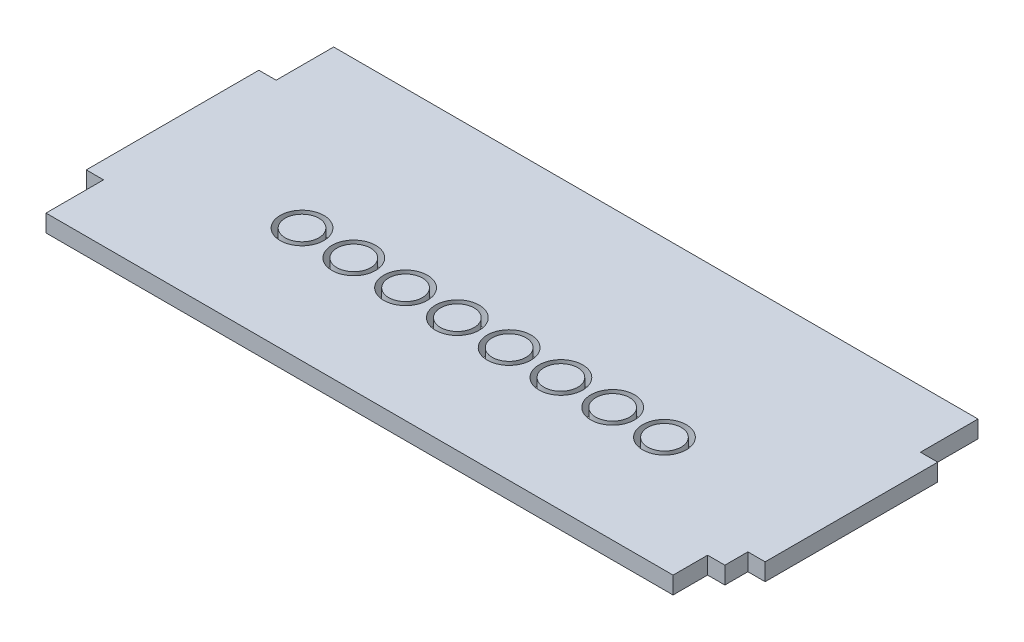
ISO-10303-21;
HEADER;
FILE_DESCRIPTION(('STEP AP214'),'2;1');
FILE_NAME('part.step','',(''),(''),'','','');
FILE_SCHEMA(('AUTOMOTIVE_DESIGN { 1 0 10303 214 1 1 1 1 }'));
ENDSEC;
DATA;
#1=APPLICATION_CONTEXT('core data for automotive mechanical design processes');
#2=APPLICATION_PROTOCOL_DEFINITION('international standard','automotive_design',2000,#1);
#3=PRODUCT_CONTEXT('',#1,'mechanical');
#4=PRODUCT('Part','Part','',(#3));
#5=PRODUCT_RELATED_PRODUCT_CATEGORY('part','',(#4));
#6=PRODUCT_DEFINITION_FORMATION('','',#4);
#7=PRODUCT_DEFINITION_CONTEXT('part definition',#1,'design');
#8=PRODUCT_DEFINITION('design','',#6,#7);
#9=PRODUCT_DEFINITION_SHAPE('','',#8);
#10=(LENGTH_UNIT() NAMED_UNIT(*) SI_UNIT(.MILLI.,.METRE.));
#11=(NAMED_UNIT(*) PLANE_ANGLE_UNIT() SI_UNIT($,.RADIAN.));
#12=(NAMED_UNIT(*) SI_UNIT($,.STERADIAN.) SOLID_ANGLE_UNIT());
#13=UNCERTAINTY_MEASURE_WITH_UNIT(LENGTH_MEASURE(1.E-05),#10,'distance_accuracy_value','');
#14=(GEOMETRIC_REPRESENTATION_CONTEXT(3) GLOBAL_UNCERTAINTY_ASSIGNED_CONTEXT((#13)) GLOBAL_UNIT_ASSIGNED_CONTEXT((#10,
#11,#12)) REPRESENTATION_CONTEXT('',''));
#15=CARTESIAN_POINT('',(0.,0.,0.));
#16=DIRECTION('',(0.,0.,1.));
#17=DIRECTION('',(1.,0.,0.));
#18=AXIS2_PLACEMENT_3D('',#15,#16,#17);
#19=CARTESIAN_POINT('',(-90.5000000000015,0.,129.999999999999));
#20=DIRECTION('',(0.,1.,0.));
#21=DIRECTION('',(0.,0.,1.));
#22=AXIS2_PLACEMENT_3D('',#19,#20,#21);
#23=CYLINDRICAL_SURFACE('',#22,2.93490979553741);
#24=CARTESIAN_POINT('',(-90.5000000000015,0.,129.999999999999));
#25=DIRECTION('',(0.,1.,0.));
#26=DIRECTION('',(0.,0.,1.));
#27=AXIS2_PLACEMENT_3D('',#24,#25,#26);
#28=CIRCLE('',#27,2.93490979553741);
#29=CARTESIAN_POINT('',(-90.5000000000015,0.,132.934909795537));
#30=VERTEX_POINT('',#29);
#31=EDGE_CURVE('E11',#30,#30,#28,.T.);
#32=ORIENTED_EDGE('',*,*,#31,.T.);
#33=EDGE_LOOP('',(#32));
#34=FACE_BOUND('',#33,.T.);
#35=CARTESIAN_POINT('',(-90.5000000000015,3.,129.999999999999));
#36=DIRECTION('',(0.,1.,0.));
#37=DIRECTION('',(0.,0.,1.));
#38=AXIS2_PLACEMENT_3D('',#35,#36,#37);
#39=CIRCLE('',#38,2.93490979553741);
#40=CARTESIAN_POINT('',(-90.5000000000015,3.,132.934909795537));
#41=VERTEX_POINT('',#40);
#42=EDGE_CURVE('E46',#41,#41,#39,.T.);
#43=ORIENTED_EDGE('',*,*,#42,.F.);
#44=EDGE_LOOP('',(#43));
#45=FACE_BOUND('',#44,.T.);
#46=ADVANCED_FACE('F43',(#34,#45),#23,.T.);
#47=CARTESIAN_POINT('',(-90.5000000000015,0.,129.999999999999));
#48=DIRECTION('',(0.,1.,0.));
#49=DIRECTION('',(0.,0.,1.));
#50=AXIS2_PLACEMENT_3D('',#47,#48,#49);
#51=PLANE('',#50);
#52=ORIENTED_EDGE('',*,*,#31,.F.);
#53=EDGE_LOOP('',(#52));
#54=FACE_BOUND('',#53,.T.);
#55=ADVANCED_FACE('F58',(#54),#51,.F.);
#56=CARTESIAN_POINT('',(-90.5000000000015,3.,129.999999999999));
#57=DIRECTION('',(0.,1.,0.));
#58=DIRECTION('',(0.,0.,1.));
#59=AXIS2_PLACEMENT_3D('',#56,#57,#58);
#60=PLANE('',#59);
#61=ORIENTED_EDGE('',*,*,#42,.T.);
#62=EDGE_LOOP('',(#61));
#63=FACE_BOUND('',#62,.T.);
#64=ADVANCED_FACE('F55',(#63),#60,.T.);
#65=CLOSED_SHELL('',(#46,#55,#64));
#66=MANIFOLD_SOLID_BREP('B2',#65);
#67=CARTESIAN_POINT('',(-81.5000000000015,0.,129.999999999999));
#68=DIRECTION('',(0.,1.,0.));
#69=DIRECTION('',(0.,0.,1.));
#70=AXIS2_PLACEMENT_3D('',#67,#68,#69);
#71=CYLINDRICAL_SURFACE('',#70,2.93490979553741);
#72=CARTESIAN_POINT('',(-81.5000000000015,0.,129.999999999999));
#73=DIRECTION('',(0.,1.,0.));
#74=DIRECTION('',(0.,0.,1.));
#75=AXIS2_PLACEMENT_3D('',#72,#73,#74);
#76=CIRCLE('',#75,2.93490979553741);
#77=CARTESIAN_POINT('',(-81.5000000000015,0.,132.934909795537));
#78=VERTEX_POINT('',#77);
#79=EDGE_CURVE('E42',#78,#78,#76,.T.);
#80=ORIENTED_EDGE('',*,*,#79,.T.);
#81=EDGE_LOOP('',(#80));
#82=FACE_BOUND('',#81,.T.);
#83=CARTESIAN_POINT('',(-81.5000000000015,3.,129.999999999999));
#84=DIRECTION('',(0.,1.,0.));
#85=DIRECTION('',(0.,0.,1.));
#86=AXIS2_PLACEMENT_3D('',#83,#84,#85);
#87=CIRCLE('',#86,2.93490979553741);
#88=CARTESIAN_POINT('',(-81.5000000000015,3.,132.934909795537));
#89=VERTEX_POINT('',#88);
#90=EDGE_CURVE('E94',#89,#89,#87,.T.);
#91=ORIENTED_EDGE('',*,*,#90,.F.);
#92=EDGE_LOOP('',(#91));
#93=FACE_BOUND('',#92,.T.);
#94=ADVANCED_FACE('F91',(#82,#93),#71,.T.);
#95=CARTESIAN_POINT('',(-81.5000000000015,0.,129.999999999999));
#96=DIRECTION('',(0.,1.,0.));
#97=DIRECTION('',(0.,0.,1.));
#98=AXIS2_PLACEMENT_3D('',#95,#96,#97);
#99=PLANE('',#98);
#100=ORIENTED_EDGE('',*,*,#79,.F.);
#101=EDGE_LOOP('',(#100));
#102=FACE_BOUND('',#101,.T.);
#103=ADVANCED_FACE('F106',(#102),#99,.F.);
#104=CARTESIAN_POINT('',(-81.5000000000015,3.,129.999999999999));
#105=DIRECTION('',(0.,1.,0.));
#106=DIRECTION('',(0.,0.,1.));
#107=AXIS2_PLACEMENT_3D('',#104,#105,#106);
#108=PLANE('',#107);
#109=ORIENTED_EDGE('',*,*,#90,.T.);
#110=EDGE_LOOP('',(#109));
#111=FACE_BOUND('',#110,.T.);
#112=ADVANCED_FACE('F103',(#111),#108,.T.);
#113=CLOSED_SHELL('',(#94,#103,#112));
#114=MANIFOLD_SOLID_BREP('B6',#113);
#115=CARTESIAN_POINT('',(-72.5000000000015,0.,129.999999999999));
#116=DIRECTION('',(0.,1.,0.));
#117=DIRECTION('',(0.,0.,1.));
#118=AXIS2_PLACEMENT_3D('',#115,#116,#117);
#119=CYLINDRICAL_SURFACE('',#118,2.93490979553741);
#120=CARTESIAN_POINT('',(-72.5000000000015,0.,129.999999999999));
#121=DIRECTION('',(0.,1.,0.));
#122=DIRECTION('',(0.,0.,1.));
#123=AXIS2_PLACEMENT_3D('',#120,#121,#122);
#124=CIRCLE('',#123,2.93490979553741);
#125=CARTESIAN_POINT('',(-72.5000000000015,0.,132.934909795537));
#126=VERTEX_POINT('',#125);
#127=EDGE_CURVE('E90',#126,#126,#124,.T.);
#128=ORIENTED_EDGE('',*,*,#127,.T.);
#129=EDGE_LOOP('',(#128));
#130=FACE_BOUND('',#129,.T.);
#131=CARTESIAN_POINT('',(-72.5000000000015,3.,129.999999999999));
#132=DIRECTION('',(0.,1.,0.));
#133=DIRECTION('',(0.,0.,1.));
#134=AXIS2_PLACEMENT_3D('',#131,#132,#133);
#135=CIRCLE('',#134,2.93490979553741);
#136=CARTESIAN_POINT('',(-72.5000000000015,3.,132.934909795537));
#137=VERTEX_POINT('',#136);
#138=EDGE_CURVE('E142',#137,#137,#135,.T.);
#139=ORIENTED_EDGE('',*,*,#138,.F.);
#140=EDGE_LOOP('',(#139));
#141=FACE_BOUND('',#140,.T.);
#142=ADVANCED_FACE('F139',(#130,#141),#119,.T.);
#143=CARTESIAN_POINT('',(-72.5000000000015,0.,129.999999999999));
#144=DIRECTION('',(0.,1.,0.));
#145=DIRECTION('',(0.,0.,1.));
#146=AXIS2_PLACEMENT_3D('',#143,#144,#145);
#147=PLANE('',#146);
#148=ORIENTED_EDGE('',*,*,#127,.F.);
#149=EDGE_LOOP('',(#148));
#150=FACE_BOUND('',#149,.T.);
#151=ADVANCED_FACE('F154',(#150),#147,.F.);
#152=CARTESIAN_POINT('',(-72.5000000000015,3.,129.999999999999));
#153=DIRECTION('',(0.,1.,0.));
#154=DIRECTION('',(0.,0.,1.));
#155=AXIS2_PLACEMENT_3D('',#152,#153,#154);
#156=PLANE('',#155);
#157=ORIENTED_EDGE('',*,*,#138,.T.);
#158=EDGE_LOOP('',(#157));
#159=FACE_BOUND('',#158,.T.);
#160=ADVANCED_FACE('F151',(#159),#156,.T.);
#161=CLOSED_SHELL('',(#142,#151,#160));
#162=MANIFOLD_SOLID_BREP('B37',#161);
#163=CARTESIAN_POINT('',(-63.5000000000015,0.,129.999999999999));
#164=DIRECTION('',(0.,1.,0.));
#165=DIRECTION('',(0.,0.,1.));
#166=AXIS2_PLACEMENT_3D('',#163,#164,#165);
#167=CYLINDRICAL_SURFACE('',#166,2.93490979553742);
#168=CARTESIAN_POINT('',(-63.5000000000015,0.,129.999999999999));
#169=DIRECTION('',(0.,1.,0.));
#170=DIRECTION('',(0.,0.,1.));
#171=AXIS2_PLACEMENT_3D('',#168,#169,#170);
#172=CIRCLE('',#171,2.93490979553742);
#173=CARTESIAN_POINT('',(-63.5000000000015,0.,132.934909795537));
#174=VERTEX_POINT('',#173);
#175=EDGE_CURVE('E138',#174,#174,#172,.T.);
#176=ORIENTED_EDGE('',*,*,#175,.T.);
#177=EDGE_LOOP('',(#176));
#178=FACE_BOUND('',#177,.T.);
#179=CARTESIAN_POINT('',(-63.5000000000015,3.,129.999999999999));
#180=DIRECTION('',(0.,1.,0.));
#181=DIRECTION('',(0.,0.,1.));
#182=AXIS2_PLACEMENT_3D('',#179,#180,#181);
#183=CIRCLE('',#182,2.93490979553742);
#184=CARTESIAN_POINT('',(-63.5000000000015,3.,132.934909795537));
#185=VERTEX_POINT('',#184);
#186=EDGE_CURVE('E190',#185,#185,#183,.T.);
#187=ORIENTED_EDGE('',*,*,#186,.F.);
#188=EDGE_LOOP('',(#187));
#189=FACE_BOUND('',#188,.T.);
#190=ADVANCED_FACE('F187',(#178,#189),#167,.T.);
#191=CARTESIAN_POINT('',(-63.5000000000015,0.,129.999999999999));
#192=DIRECTION('',(0.,1.,0.));
#193=DIRECTION('',(0.,0.,1.));
#194=AXIS2_PLACEMENT_3D('',#191,#192,#193);
#195=PLANE('',#194);
#196=ORIENTED_EDGE('',*,*,#175,.F.);
#197=EDGE_LOOP('',(#196));
#198=FACE_BOUND('',#197,.T.);
#199=ADVANCED_FACE('F202',(#198),#195,.F.);
#200=CARTESIAN_POINT('',(-63.5000000000015,3.,129.999999999999));
#201=DIRECTION('',(0.,1.,0.));
#202=DIRECTION('',(0.,0.,1.));
#203=AXIS2_PLACEMENT_3D('',#200,#201,#202);
#204=PLANE('',#203);
#205=ORIENTED_EDGE('',*,*,#186,.T.);
#206=EDGE_LOOP('',(#205));
#207=FACE_BOUND('',#206,.T.);
#208=ADVANCED_FACE('F199',(#207),#204,.T.);
#209=CLOSED_SHELL('',(#190,#199,#208));
#210=MANIFOLD_SOLID_BREP('B85',#209);
#211=CARTESIAN_POINT('',(-54.5000000000015,0.,129.999999999999));
#212=DIRECTION('',(0.,1.,0.));
#213=DIRECTION('',(0.,0.,1.));
#214=AXIS2_PLACEMENT_3D('',#211,#212,#213);
#215=CYLINDRICAL_SURFACE('',#214,2.93490979553741);
#216=CARTESIAN_POINT('',(-54.5000000000015,0.,129.999999999999));
#217=DIRECTION('',(0.,1.,0.));
#218=DIRECTION('',(0.,0.,1.));
#219=AXIS2_PLACEMENT_3D('',#216,#217,#218);
#220=CIRCLE('',#219,2.93490979553741);
#221=CARTESIAN_POINT('',(-54.5000000000015,0.,132.934909795536));
#222=VERTEX_POINT('',#221);
#223=EDGE_CURVE('E186',#222,#222,#220,.T.);
#224=ORIENTED_EDGE('',*,*,#223,.T.);
#225=EDGE_LOOP('',(#224));
#226=FACE_BOUND('',#225,.T.);
#227=CARTESIAN_POINT('',(-54.5000000000015,3.,129.999999999999));
#228=DIRECTION('',(0.,1.,0.));
#229=DIRECTION('',(0.,0.,1.));
#230=AXIS2_PLACEMENT_3D('',#227,#228,#229);
#231=CIRCLE('',#230,2.93490979553741);
#232=CARTESIAN_POINT('',(-54.5000000000015,3.,132.934909795536));
#233=VERTEX_POINT('',#232);
#234=EDGE_CURVE('E238',#233,#233,#231,.T.);
#235=ORIENTED_EDGE('',*,*,#234,.F.);
#236=EDGE_LOOP('',(#235));
#237=FACE_BOUND('',#236,.T.);
#238=ADVANCED_FACE('F235',(#226,#237),#215,.T.);
#239=CARTESIAN_POINT('',(-54.5000000000015,0.,129.999999999999));
#240=DIRECTION('',(0.,1.,0.));
#241=DIRECTION('',(0.,0.,1.));
#242=AXIS2_PLACEMENT_3D('',#239,#240,#241);
#243=PLANE('',#242);
#244=ORIENTED_EDGE('',*,*,#223,.F.);
#245=EDGE_LOOP('',(#244));
#246=FACE_BOUND('',#245,.T.);
#247=ADVANCED_FACE('F250',(#246),#243,.F.);
#248=CARTESIAN_POINT('',(-54.5000000000015,3.,129.999999999999));
#249=DIRECTION('',(0.,1.,0.));
#250=DIRECTION('',(0.,0.,1.));
#251=AXIS2_PLACEMENT_3D('',#248,#249,#250);
#252=PLANE('',#251);
#253=ORIENTED_EDGE('',*,*,#234,.T.);
#254=EDGE_LOOP('',(#253));
#255=FACE_BOUND('',#254,.T.);
#256=ADVANCED_FACE('F247',(#255),#252,.T.);
#257=CLOSED_SHELL('',(#238,#247,#256));
#258=MANIFOLD_SOLID_BREP('B133',#257);
#259=CARTESIAN_POINT('',(-45.5000000000015,0.,129.999999999999));
#260=DIRECTION('',(0.,1.,0.));
#261=DIRECTION('',(0.,0.,1.));
#262=AXIS2_PLACEMENT_3D('',#259,#260,#261);
#263=CYLINDRICAL_SURFACE('',#262,2.93490979553741);
#264=CARTESIAN_POINT('',(-45.5000000000015,0.,129.999999999999));
#265=DIRECTION('',(0.,1.,0.));
#266=DIRECTION('',(0.,0.,1.));
#267=AXIS2_PLACEMENT_3D('',#264,#265,#266);
#268=CIRCLE('',#267,2.93490979553741);
#269=CARTESIAN_POINT('',(-45.5000000000015,0.,132.934909795536));
#270=VERTEX_POINT('',#269);
#271=EDGE_CURVE('E234',#270,#270,#268,.T.);
#272=ORIENTED_EDGE('',*,*,#271,.T.);
#273=EDGE_LOOP('',(#272));
#274=FACE_BOUND('',#273,.T.);
#275=CARTESIAN_POINT('',(-45.5000000000015,3.,129.999999999999));
#276=DIRECTION('',(0.,1.,0.));
#277=DIRECTION('',(0.,0.,1.));
#278=AXIS2_PLACEMENT_3D('',#275,#276,#277);
#279=CIRCLE('',#278,2.93490979553741);
#280=CARTESIAN_POINT('',(-45.5000000000015,3.,132.934909795536));
#281=VERTEX_POINT('',#280);
#282=EDGE_CURVE('E286',#281,#281,#279,.T.);
#283=ORIENTED_EDGE('',*,*,#282,.F.);
#284=EDGE_LOOP('',(#283));
#285=FACE_BOUND('',#284,.T.);
#286=ADVANCED_FACE('F283',(#274,#285),#263,.T.);
#287=CARTESIAN_POINT('',(-45.5000000000015,0.,129.999999999999));
#288=DIRECTION('',(0.,1.,0.));
#289=DIRECTION('',(0.,0.,1.));
#290=AXIS2_PLACEMENT_3D('',#287,#288,#289);
#291=PLANE('',#290);
#292=ORIENTED_EDGE('',*,*,#271,.F.);
#293=EDGE_LOOP('',(#292));
#294=FACE_BOUND('',#293,.T.);
#295=ADVANCED_FACE('F298',(#294),#291,.F.);
#296=CARTESIAN_POINT('',(-45.5000000000015,3.,129.999999999999));
#297=DIRECTION('',(0.,1.,0.));
#298=DIRECTION('',(0.,0.,1.));
#299=AXIS2_PLACEMENT_3D('',#296,#297,#298);
#300=PLANE('',#299);
#301=ORIENTED_EDGE('',*,*,#282,.T.);
#302=EDGE_LOOP('',(#301));
#303=FACE_BOUND('',#302,.T.);
#304=ADVANCED_FACE('F295',(#303),#300,.T.);
#305=CLOSED_SHELL('',(#286,#295,#304));
#306=MANIFOLD_SOLID_BREP('B181',#305);
#307=CARTESIAN_POINT('',(-36.5000000000015,0.,129.999999999999));
#308=DIRECTION('',(0.,1.,0.));
#309=DIRECTION('',(0.,0.,1.));
#310=AXIS2_PLACEMENT_3D('',#307,#308,#309);
#311=CYLINDRICAL_SURFACE('',#310,2.93490979553741);
#312=CARTESIAN_POINT('',(-36.5000000000015,0.,129.999999999999));
#313=DIRECTION('',(0.,1.,0.));
#314=DIRECTION('',(0.,0.,1.));
#315=AXIS2_PLACEMENT_3D('',#312,#313,#314);
#316=CIRCLE('',#315,2.93490979553741);
#317=CARTESIAN_POINT('',(-36.5000000000015,0.,132.934909795536));
#318=VERTEX_POINT('',#317);
#319=EDGE_CURVE('E282',#318,#318,#316,.T.);
#320=ORIENTED_EDGE('',*,*,#319,.T.);
#321=EDGE_LOOP('',(#320));
#322=FACE_BOUND('',#321,.T.);
#323=CARTESIAN_POINT('',(-36.5000000000015,3.,129.999999999999));
#324=DIRECTION('',(0.,1.,0.));
#325=DIRECTION('',(0.,0.,1.));
#326=AXIS2_PLACEMENT_3D('',#323,#324,#325);
#327=CIRCLE('',#326,2.93490979553741);
#328=CARTESIAN_POINT('',(-36.5000000000015,3.,132.934909795536));
#329=VERTEX_POINT('',#328);
#330=EDGE_CURVE('E334',#329,#329,#327,.T.);
#331=ORIENTED_EDGE('',*,*,#330,.F.);
#332=EDGE_LOOP('',(#331));
#333=FACE_BOUND('',#332,.T.);
#334=ADVANCED_FACE('F331',(#322,#333),#311,.T.);
#335=CARTESIAN_POINT('',(-36.5000000000015,0.,129.999999999999));
#336=DIRECTION('',(0.,1.,0.));
#337=DIRECTION('',(0.,0.,1.));
#338=AXIS2_PLACEMENT_3D('',#335,#336,#337);
#339=PLANE('',#338);
#340=ORIENTED_EDGE('',*,*,#319,.F.);
#341=EDGE_LOOP('',(#340));
#342=FACE_BOUND('',#341,.T.);
#343=ADVANCED_FACE('F346',(#342),#339,.F.);
#344=CARTESIAN_POINT('',(-36.5000000000015,3.,129.999999999999));
#345=DIRECTION('',(0.,1.,0.));
#346=DIRECTION('',(0.,0.,1.));
#347=AXIS2_PLACEMENT_3D('',#344,#345,#346);
#348=PLANE('',#347);
#349=ORIENTED_EDGE('',*,*,#330,.T.);
#350=EDGE_LOOP('',(#349));
#351=FACE_BOUND('',#350,.T.);
#352=ADVANCED_FACE('F343',(#351),#348,.T.);
#353=CLOSED_SHELL('',(#334,#343,#352));
#354=MANIFOLD_SOLID_BREP('B229',#353);
#355=CARTESIAN_POINT('',(-27.5000000000015,0.,129.999999999999));
#356=DIRECTION('',(0.,1.,0.));
#357=DIRECTION('',(0.,0.,1.));
#358=AXIS2_PLACEMENT_3D('',#355,#356,#357);
#359=CYLINDRICAL_SURFACE('',#358,2.93490979553741);
#360=CARTESIAN_POINT('',(-27.5000000000015,0.,129.999999999999));
#361=DIRECTION('',(0.,1.,0.));
#362=DIRECTION('',(0.,0.,1.));
#363=AXIS2_PLACEMENT_3D('',#360,#361,#362);
#364=CIRCLE('',#363,2.93490979553741);
#365=CARTESIAN_POINT('',(-27.5000000000015,0.,132.934909795536));
#366=VERTEX_POINT('',#365);
#367=EDGE_CURVE('E330',#366,#366,#364,.T.);
#368=ORIENTED_EDGE('',*,*,#367,.T.);
#369=EDGE_LOOP('',(#368));
#370=FACE_BOUND('',#369,.T.);
#371=CARTESIAN_POINT('',(-27.5000000000015,3.,129.999999999999));
#372=DIRECTION('',(0.,1.,0.));
#373=DIRECTION('',(0.,0.,1.));
#374=AXIS2_PLACEMENT_3D('',#371,#372,#373);
#375=CIRCLE('',#374,2.93490979553741);
#376=CARTESIAN_POINT('',(-27.5000000000015,3.,132.934909795536));
#377=VERTEX_POINT('',#376);
#378=EDGE_CURVE('E383',#377,#377,#375,.T.);
#379=ORIENTED_EDGE('',*,*,#378,.F.);
#380=EDGE_LOOP('',(#379));
#381=FACE_BOUND('',#380,.T.);
#382=ADVANCED_FACE('F380',(#370,#381),#359,.T.);
#383=CARTESIAN_POINT('',(-27.5000000000015,0.,129.999999999999));
#384=DIRECTION('',(0.,1.,0.));
#385=DIRECTION('',(0.,0.,1.));
#386=AXIS2_PLACEMENT_3D('',#383,#384,#385);
#387=PLANE('',#386);
#388=ORIENTED_EDGE('',*,*,#367,.F.);
#389=EDGE_LOOP('',(#388));
#390=FACE_BOUND('',#389,.T.);
#391=ADVANCED_FACE('F395',(#390),#387,.F.);
#392=CARTESIAN_POINT('',(-27.5000000000015,3.,129.999999999999));
#393=DIRECTION('',(0.,1.,0.));
#394=DIRECTION('',(0.,0.,1.));
#395=AXIS2_PLACEMENT_3D('',#392,#393,#394);
#396=PLANE('',#395);
#397=ORIENTED_EDGE('',*,*,#378,.T.);
#398=EDGE_LOOP('',(#397));
#399=FACE_BOUND('',#398,.T.);
#400=ADVANCED_FACE('F392',(#399),#396,.T.);
#401=CLOSED_SHELL('',(#382,#391,#400));
#402=MANIFOLD_SOLID_BREP('B277',#401);
#403=CARTESIAN_POINT('',(-1.5404344466674E-12,12.,139.999999999999));
#404=DIRECTION('',(0.,0.,-1.));
#405=DIRECTION('',(-1.,0.,0.));
#406=AXIS2_PLACEMENT_3D('',#403,#404,#405);
#407=PLANE('',#406);
#408=DIRECTION('',(1.,0.,0.));
#409=VECTOR('',#408,1.);
#410=CARTESIAN_POINT('',(-1.5404344466674E-12,3.,139.999999999999));
#411=LINE('',#410,#409);
#412=CARTESIAN_POINT('',(-3.00000000000154,3.,139.999999999999));
#413=VERTEX_POINT('',#412);
#414=CARTESIAN_POINT('',(-1.5404344466674E-12,3.,139.999999999999));
#415=VERTEX_POINT('',#414);
#416=EDGE_CURVE('E434',#413,#415,#411,.T.);
#417=ORIENTED_EDGE('',*,*,#416,.F.);
#418=DIRECTION('',(0.,1.,0.));
#419=VECTOR('',#418,1.);
#420=CARTESIAN_POINT('',(-3.00000000000154,0.,139.999999999999));
#421=LINE('',#420,#419);
#422=CARTESIAN_POINT('',(-3.00000000000154,0.,139.999999999999));
#423=VERTEX_POINT('',#422);
#424=EDGE_CURVE('E563',#423,#413,#421,.T.);
#425=ORIENTED_EDGE('',*,*,#424,.F.);
#426=DIRECTION('',(1.,0.,0.));
#427=VECTOR('',#426,1.);
#428=CARTESIAN_POINT('',(-1.5404344466674E-12,0.,139.999999999999));
#429=LINE('',#428,#427);
#430=CARTESIAN_POINT('',(-1.5404344466674E-12,0.,139.999999999999));
#431=VERTEX_POINT('',#430);
#432=EDGE_CURVE('E579',#423,#431,#429,.T.);
#433=ORIENTED_EDGE('',*,*,#432,.T.);
#434=DIRECTION('',(0.,1.,0.));
#435=VECTOR('',#434,1.);
#436=CARTESIAN_POINT('',(-1.5404344466674E-12,0.,139.999999999999));
#437=LINE('',#436,#435);
#438=EDGE_CURVE('E626',#431,#415,#437,.T.);
#439=ORIENTED_EDGE('',*,*,#438,.T.);
#440=EDGE_LOOP('',(#417,#425,#433,#439));
#441=FACE_BOUND('',#440,.T.);
#442=ADVANCED_FACE('F420',(#441),#407,.F.);
#443=CARTESIAN_POINT('',(-1.62370117351429E-12,12.,109.999999999999));
#444=DIRECTION('',(0.,0.,-1.));
#445=DIRECTION('',(-1.,0.,0.));
#446=AXIS2_PLACEMENT_3D('',#443,#444,#445);
#447=PLANE('',#446);
#448=DIRECTION('',(0.,1.,0.));
#449=VECTOR('',#448,1.);
#450=CARTESIAN_POINT('',(-2.99999999999846,0.,109.999999999999));
#451=LINE('',#450,#449);
#452=CARTESIAN_POINT('',(-2.99999999999846,0.,109.999999999999));
#453=VERTEX_POINT('',#452);
#454=CARTESIAN_POINT('',(-2.99999999999846,3.,109.999999999999));
#455=VERTEX_POINT('',#454);
#456=EDGE_CURVE('E594',#453,#455,#451,.T.);
#457=ORIENTED_EDGE('',*,*,#456,.T.);
#458=DIRECTION('',(1.,0.,0.));
#459=VECTOR('',#458,1.);
#460=CARTESIAN_POINT('',(-1.62370117351429E-12,3.,109.999999999999));
#461=LINE('',#460,#459);
#462=CARTESIAN_POINT('',(-1.52395457364563E-12,3.,109.999999999999));
#463=VERTEX_POINT('',#462);
#464=EDGE_CURVE('E634',#455,#463,#461,.T.);
#465=ORIENTED_EDGE('',*,*,#464,.T.);
#466=DIRECTION('',(0.,1.,0.));
#467=VECTOR('',#466,1.);
#468=CARTESIAN_POINT('',(-3.05311331771916E-13,0.,109.999999999999));
#469=LINE('',#468,#467);
#470=CARTESIAN_POINT('',(-1.5404344466674E-12,0.,109.999999999999));
#471=VERTEX_POINT('',#470);
#472=EDGE_CURVE('E625',#471,#463,#469,.T.);
#473=ORIENTED_EDGE('',*,*,#472,.F.);
#474=DIRECTION('',(1.,0.,0.));
#475=VECTOR('',#474,1.);
#476=CARTESIAN_POINT('',(-1.62370117351429E-12,0.,109.999999999999));
#477=LINE('',#476,#475);
#478=EDGE_CURVE('E601',#453,#471,#477,.T.);
#479=ORIENTED_EDGE('',*,*,#478,.F.);
#480=EDGE_LOOP('',(#457,#465,#473,#479));
#481=FACE_BOUND('',#480,.T.);
#482=ADVANCED_FACE('F738',(#481),#447,.T.);
#483=CARTESIAN_POINT('',(-118.000000000001,12.,109.999999999999));
#484=DIRECTION('',(0.,0.,1.));
#485=DIRECTION('',(1.,0.,0.));
#486=AXIS2_PLACEMENT_3D('',#483,#484,#485);
#487=PLANE('',#486);
#488=DIRECTION('',(-1.,0.,0.));
#489=VECTOR('',#488,1.);
#490=CARTESIAN_POINT('',(-118.000000000001,3.,109.999999999999));
#491=LINE('',#490,#489);
#492=CARTESIAN_POINT('',(-115.000000000005,3.,109.999999999999));
#493=VERTEX_POINT('',#492);
#494=CARTESIAN_POINT('',(-118.000000000002,3.,109.999999999999));
#495=VERTEX_POINT('',#494);
#496=EDGE_CURVE('E518',#493,#495,#491,.T.);
#497=ORIENTED_EDGE('',*,*,#496,.F.);
#498=DIRECTION('',(0.,1.,0.));
#499=VECTOR('',#498,1.);
#500=CARTESIAN_POINT('',(-115.000000000005,0.,109.999999999999));
#501=LINE('',#500,#499);
#502=CARTESIAN_POINT('',(-115.000000000005,0.,109.999999999999));
#503=VERTEX_POINT('',#502);
#504=EDGE_CURVE('E592',#503,#493,#501,.T.);
#505=ORIENTED_EDGE('',*,*,#504,.F.);
#506=DIRECTION('',(-1.,0.,0.));
#507=VECTOR('',#506,1.);
#508=CARTESIAN_POINT('',(-118.000000000001,0.,109.999999999999));
#509=LINE('',#508,#507);
#510=CARTESIAN_POINT('',(-118.000000000001,0.,109.999999999999));
#511=VERTEX_POINT('',#510);
#512=EDGE_CURVE('E543',#503,#511,#509,.T.);
#513=ORIENTED_EDGE('',*,*,#512,.T.);
#514=DIRECTION('',(0.,1.,0.));
#515=VECTOR('',#514,1.);
#516=CARTESIAN_POINT('',(-118.000000000001,0.,109.999999999999));
#517=LINE('',#516,#515);
#518=EDGE_CURVE('E534',#511,#495,#517,.T.);
#519=ORIENTED_EDGE('',*,*,#518,.T.);
#520=EDGE_LOOP('',(#497,#505,#513,#519));
#521=FACE_BOUND('',#520,.T.);
#522=ADVANCED_FACE('F542',(#521),#487,.F.);
#523=CARTESIAN_POINT('',(-118.000000000002,12.,139.999999999999));
#524=DIRECTION('',(0.,0.,1.));
#525=DIRECTION('',(1.,0.,0.));
#526=AXIS2_PLACEMENT_3D('',#523,#524,#525);
#527=PLANE('',#526);
#528=DIRECTION('',(0.,1.,0.));
#529=VECTOR('',#528,1.);
#530=CARTESIAN_POINT('',(-115.000000000002,0.,139.999999999999));
#531=LINE('',#530,#529);
#532=CARTESIAN_POINT('',(-115.000000000002,0.,139.999999999999));
#533=VERTEX_POINT('',#532);
#534=CARTESIAN_POINT('',(-115.000000000002,3.,139.999999999999));
#535=VERTEX_POINT('',#534);
#536=EDGE_CURVE('E574',#533,#535,#531,.T.);
#537=ORIENTED_EDGE('',*,*,#536,.T.);
#538=DIRECTION('',(-1.,0.,0.));
#539=VECTOR('',#538,1.);
#540=CARTESIAN_POINT('',(-118.000000000002,3.,139.999999999999));
#541=LINE('',#540,#539);
#542=CARTESIAN_POINT('',(-118.000000000002,3.,139.999999999999));
#543=VERTEX_POINT('',#542);
#544=EDGE_CURVE('E623',#535,#543,#541,.T.);
#545=ORIENTED_EDGE('',*,*,#544,.T.);
#546=DIRECTION('',(0.,1.,0.));
#547=VECTOR('',#546,1.);
#548=CARTESIAN_POINT('',(-118.000000000002,0.,139.999999999999));
#549=LINE('',#548,#547);
#550=CARTESIAN_POINT('',(-118.000000000001,0.,139.999999999999));
#551=VERTEX_POINT('',#550);
#552=EDGE_CURVE('E537',#551,#543,#549,.T.);
#553=ORIENTED_EDGE('',*,*,#552,.F.);
#554=DIRECTION('',(-1.,0.,0.));
#555=VECTOR('',#554,1.);
#556=CARTESIAN_POINT('',(-118.000000000002,0.,139.999999999999));
#557=LINE('',#556,#555);
#558=EDGE_CURVE('E605',#533,#551,#557,.T.);
#559=ORIENTED_EDGE('',*,*,#558,.F.);
#560=EDGE_LOOP('',(#537,#545,#553,#559));
#561=FACE_BOUND('',#560,.T.);
#562=ADVANCED_FACE('F622',(#561),#527,.T.);
#563=CARTESIAN_POINT('',(-1.5404344466674E-12,12.,149.999999999999));
#564=DIRECTION('',(0.,0.,1.));
#565=DIRECTION('',(1.,0.,0.));
#566=AXIS2_PLACEMENT_3D('',#563,#564,#565);
#567=PLANE('',#566);
#568=DIRECTION('',(0.,1.,0.));
#569=VECTOR('',#568,1.);
#570=CARTESIAN_POINT('',(-6.00197015274353,0.,149.999999999999));
#571=LINE('',#570,#569);
#572=CARTESIAN_POINT('',(-6.00197015274353,0.,149.999999999999));
#573=VERTEX_POINT('',#572);
#574=CARTESIAN_POINT('',(-6.00197015274354,3.,149.999999999999));
#575=VERTEX_POINT('',#574);
#576=EDGE_CURVE('E566',#573,#575,#571,.T.);
#577=ORIENTED_EDGE('',*,*,#576,.T.);
#578=DIRECTION('',(1.,0.,0.));
#579=VECTOR('',#578,1.);
#580=CARTESIAN_POINT('',(-118.000000000002,3.,149.999999999999));
#581=LINE('',#580,#579);
#582=CARTESIAN_POINT('',(-115.000000000002,3.,149.999999999999));
#583=VERTEX_POINT('',#582);
#584=EDGE_CURVE('E538',#583,#575,#581,.T.);
#585=ORIENTED_EDGE('',*,*,#584,.F.);
#586=DIRECTION('',(0.,1.,0.));
#587=VECTOR('',#586,1.);
#588=CARTESIAN_POINT('',(-115.000000000002,0.,149.999999999999));
#589=LINE('',#588,#587);
#590=CARTESIAN_POINT('',(-115.000000000002,0.,149.999999999999));
#591=VERTEX_POINT('',#590);
#592=EDGE_CURVE('E576',#591,#583,#589,.T.);
#593=ORIENTED_EDGE('',*,*,#592,.F.);
#594=DIRECTION('',(-1.,0.,0.));
#595=VECTOR('',#594,1.);
#596=CARTESIAN_POINT('',(-1.5404344466674E-12,0.,149.999999999999));
#597=LINE('',#596,#595);
#598=EDGE_CURVE('E427',#573,#591,#597,.T.);
#599=ORIENTED_EDGE('',*,*,#598,.F.);
#600=EDGE_LOOP('',(#577,#585,#593,#599));
#601=FACE_BOUND('',#600,.T.);
#602=ADVANCED_FACE('F615',(#601),#567,.T.);
#603=CARTESIAN_POINT('',(-115.000000000002,0.,0.));
#604=DIRECTION('',(1.,0.,0.));
#605=DIRECTION('',(0.,0.,-1.));
#606=AXIS2_PLACEMENT_3D('',#603,#604,#605);
#607=PLANE('',#606);
#608=DIRECTION('',(0.,0.,1.));
#609=VECTOR('',#608,1.);
#610=CARTESIAN_POINT('',(-115.000000000002,3.,0.));
#611=LINE('',#610,#609);
#612=EDGE_CURVE('E529',#535,#583,#611,.T.);
#613=ORIENTED_EDGE('',*,*,#612,.F.);
#614=ORIENTED_EDGE('',*,*,#536,.F.);
#615=DIRECTION('',(0.,0.,-1.));
#616=VECTOR('',#615,1.);
#617=CARTESIAN_POINT('',(-115.000000000002,0.,0.));
#618=LINE('',#617,#616);
#619=EDGE_CURVE('E571',#591,#533,#618,.T.);
#620=ORIENTED_EDGE('',*,*,#619,.F.);
#621=ORIENTED_EDGE('',*,*,#592,.T.);
#622=EDGE_LOOP('',(#613,#614,#620,#621));
#623=FACE_BOUND('',#622,.T.);
#624=ADVANCED_FACE('F619',(#623),#607,.F.);
#625=CARTESIAN_POINT('',(0.,0.,99.9999999999988));
#626=DIRECTION('',(0.,0.,-1.));
#627=DIRECTION('',(-1.,0.,0.));
#628=AXIS2_PLACEMENT_3D('',#625,#626,#627);
#629=PLANE('',#628);
#630=DIRECTION('',(0.,1.,0.));
#631=VECTOR('',#630,1.);
#632=CARTESIAN_POINT('',(-115.000000000005,0.,99.9999999999988));
#633=LINE('',#632,#631);
#634=CARTESIAN_POINT('',(-115.000000000005,0.,99.9999999999988));
#635=VERTEX_POINT('',#634);
#636=CARTESIAN_POINT('',(-115.000000000005,3.,99.9999999999988));
#637=VERTEX_POINT('',#636);
#638=EDGE_CURVE('E575',#635,#637,#633,.T.);
#639=ORIENTED_EDGE('',*,*,#638,.T.);
#640=DIRECTION('',(-1.,0.,0.));
#641=VECTOR('',#640,1.);
#642=CARTESIAN_POINT('',(-118.000000000002,3.,99.9999999999988));
#643=LINE('',#642,#641);
#644=CARTESIAN_POINT('',(-2.99999999999846,3.,99.9999999999988));
#645=VERTEX_POINT('',#644);
#646=EDGE_CURVE('E648',#645,#637,#643,.T.);
#647=ORIENTED_EDGE('',*,*,#646,.F.);
#648=DIRECTION('',(0.,1.,0.));
#649=VECTOR('',#648,1.);
#650=CARTESIAN_POINT('',(-2.99999999999846,0.,99.9999999999988));
#651=LINE('',#650,#649);
#652=CARTESIAN_POINT('',(-2.99999999999846,0.,99.9999999999988));
#653=VERTEX_POINT('',#652);
#654=EDGE_CURVE('E589',#653,#645,#651,.T.);
#655=ORIENTED_EDGE('',*,*,#654,.F.);
#656=DIRECTION('',(-1.,0.,0.));
#657=VECTOR('',#656,1.);
#658=CARTESIAN_POINT('',(0.,0.,99.9999999999988));
#659=LINE('',#658,#657);
#660=EDGE_CURVE('E562',#653,#635,#659,.T.);
#661=ORIENTED_EDGE('',*,*,#660,.T.);
#662=EDGE_LOOP('',(#639,#647,#655,#661));
#663=FACE_BOUND('',#662,.T.);
#664=ADVANCED_FACE('F757',(#663),#629,.T.);
#665=CARTESIAN_POINT('',(-115.000000000005,0.,0.));
#666=DIRECTION('',(-1.,0.,0.));
#667=DIRECTION('',(0.,0.,1.));
#668=AXIS2_PLACEMENT_3D('',#665,#666,#667);
#669=PLANE('',#668);
#670=ORIENTED_EDGE('',*,*,#504,.T.);
#671=DIRECTION('',(0.,0.,-1.));
#672=VECTOR('',#671,1.);
#673=CARTESIAN_POINT('',(-115.000000000005,3.,0.));
#674=LINE('',#673,#672);
#675=EDGE_CURVE('E524',#493,#637,#674,.T.);
#676=ORIENTED_EDGE('',*,*,#675,.T.);
#677=ORIENTED_EDGE('',*,*,#638,.F.);
#678=DIRECTION('',(0.,0.,1.));
#679=VECTOR('',#678,1.);
#680=CARTESIAN_POINT('',(-115.000000000005,0.,0.));
#681=LINE('',#680,#679);
#682=EDGE_CURVE('E586',#635,#503,#681,.T.);
#683=ORIENTED_EDGE('',*,*,#682,.T.);
#684=EDGE_LOOP('',(#670,#676,#677,#683));
#685=FACE_BOUND('',#684,.T.);
#686=ADVANCED_FACE('F760',(#685),#669,.T.);
#687=CARTESIAN_POINT('',(-2.99999999999846,0.,0.));
#688=DIRECTION('',(-1.,0.,0.));
#689=DIRECTION('',(0.,0.,1.));
#690=AXIS2_PLACEMENT_3D('',#687,#688,#689);
#691=PLANE('',#690);
#692=DIRECTION('',(0.,0.,-1.));
#693=VECTOR('',#692,1.);
#694=CARTESIAN_POINT('',(-2.99999999999846,3.,0.));
#695=LINE('',#694,#693);
#696=EDGE_CURVE('E637',#455,#645,#695,.T.);
#697=ORIENTED_EDGE('',*,*,#696,.F.);
#698=ORIENTED_EDGE('',*,*,#456,.F.);
#699=DIRECTION('',(0.,0.,1.));
#700=VECTOR('',#699,1.);
#701=CARTESIAN_POINT('',(-2.99999999999846,0.,0.));
#702=LINE('',#701,#700);
#703=EDGE_CURVE('E583',#653,#453,#702,.T.);
#704=ORIENTED_EDGE('',*,*,#703,.F.);
#705=ORIENTED_EDGE('',*,*,#654,.T.);
#706=EDGE_LOOP('',(#697,#698,#704,#705));
#707=FACE_BOUND('',#706,.T.);
#708=ADVANCED_FACE('F754',(#707),#691,.F.);
#709=CARTESIAN_POINT('',(0.,0.,143.999999999999));
#710=DIRECTION('',(0.,0.,1.));
#711=DIRECTION('',(1.,0.,0.));
#712=AXIS2_PLACEMENT_3D('',#709,#710,#711);
#713=PLANE('',#712);
#714=DIRECTION('',(0.,1.,0.));
#715=VECTOR('',#714,1.);
#716=CARTESIAN_POINT('',(-3.00000000000154,0.,143.999999999999));
#717=LINE('',#716,#715);
#718=CARTESIAN_POINT('',(-3.00000000000154,0.,143.999999999999));
#719=VERTEX_POINT('',#718);
#720=CARTESIAN_POINT('',(-3.00000000000154,3.,143.999999999999));
#721=VERTEX_POINT('',#720);
#722=EDGE_CURVE('E559',#719,#721,#717,.T.);
#723=ORIENTED_EDGE('',*,*,#722,.T.);
#724=DIRECTION('',(-1.,0.,0.));
#725=VECTOR('',#724,1.);
#726=CARTESIAN_POINT('',(0.,3.,143.999999999999));
#727=LINE('',#726,#725);
#728=CARTESIAN_POINT('',(-6.00197015274353,3.,143.999999999999));
#729=VERTEX_POINT('',#728);
#730=EDGE_CURVE('E643',#721,#729,#727,.T.);
#731=ORIENTED_EDGE('',*,*,#730,.T.);
#732=DIRECTION('',(0.,1.,0.));
#733=VECTOR('',#732,1.);
#734=CARTESIAN_POINT('',(-6.00197015274353,0.,143.999999999999));
#735=LINE('',#734,#733);
#736=CARTESIAN_POINT('',(-6.00197015274353,0.,143.999999999999));
#737=VERTEX_POINT('',#736);
#738=EDGE_CURVE('E558',#737,#729,#735,.T.);
#739=ORIENTED_EDGE('',*,*,#738,.F.);
#740=DIRECTION('',(1.,0.,0.));
#741=VECTOR('',#740,1.);
#742=CARTESIAN_POINT('',(0.,0.,143.999999999999));
#743=LINE('',#742,#741);
#744=EDGE_CURVE('E544',#737,#719,#743,.T.);
#745=ORIENTED_EDGE('',*,*,#744,.T.);
#746=EDGE_LOOP('',(#723,#731,#739,#745));
#747=FACE_BOUND('',#746,.T.);
#748=ADVANCED_FACE('F767',(#747),#713,.T.);
#749=CARTESIAN_POINT('',(-3.00000000000154,0.,0.));
#750=DIRECTION('',(1.,0.,0.));
#751=DIRECTION('',(0.,0.,-1.));
#752=AXIS2_PLACEMENT_3D('',#749,#750,#751);
#753=PLANE('',#752);
#754=ORIENTED_EDGE('',*,*,#424,.T.);
#755=DIRECTION('',(0.,0.,1.));
#756=VECTOR('',#755,1.);
#757=CARTESIAN_POINT('',(-3.00000000000154,3.,0.));
#758=LINE('',#757,#756);
#759=EDGE_CURVE('E640',#413,#721,#758,.T.);
#760=ORIENTED_EDGE('',*,*,#759,.T.);
#761=ORIENTED_EDGE('',*,*,#722,.F.);
#762=DIRECTION('',(0.,0.,-1.));
#763=VECTOR('',#762,1.);
#764=CARTESIAN_POINT('',(-3.00000000000154,0.,0.));
#765=LINE('',#764,#763);
#766=EDGE_CURVE('E555',#719,#423,#765,.T.);
#767=ORIENTED_EDGE('',*,*,#766,.T.);
#768=EDGE_LOOP('',(#754,#760,#761,#767));
#769=FACE_BOUND('',#768,.T.);
#770=ADVANCED_FACE('F746',(#769),#753,.T.);
#771=CARTESIAN_POINT('',(-6.00197015274355,0.,0.));
#772=DIRECTION('',(-1.,0.,0.));
#773=DIRECTION('',(0.,0.,1.));
#774=AXIS2_PLACEMENT_3D('',#771,#772,#773);
#775=PLANE('',#774);
#776=DIRECTION('',(0.,0.,-1.));
#777=VECTOR('',#776,1.);
#778=CARTESIAN_POINT('',(-6.00197015274355,3.,0.));
#779=LINE('',#778,#777);
#780=EDGE_CURVE('E646',#575,#729,#779,.T.);
#781=ORIENTED_EDGE('',*,*,#780,.F.);
#782=ORIENTED_EDGE('',*,*,#576,.F.);
#783=DIRECTION('',(0.,0.,1.));
#784=VECTOR('',#783,1.);
#785=CARTESIAN_POINT('',(-6.00197015274355,0.,0.));
#786=LINE('',#785,#784);
#787=EDGE_CURVE('E546',#737,#573,#786,.T.);
#788=ORIENTED_EDGE('',*,*,#787,.F.);
#789=ORIENTED_EDGE('',*,*,#738,.T.);
#790=EDGE_LOOP('',(#781,#782,#788,#789));
#791=FACE_BOUND('',#790,.T.);
#792=ADVANCED_FACE('F837',(#791),#775,.F.);
#793=CARTESIAN_POINT('',(-118.000000000002,0.,0.));
#794=DIRECTION('',(1.,0.,0.));
#795=DIRECTION('',(0.,0.,-1.));
#796=AXIS2_PLACEMENT_3D('',#793,#794,#795);
#797=PLANE('',#796);
#798=DIRECTION('',(0.,0.,1.));
#799=VECTOR('',#798,1.);
#800=CARTESIAN_POINT('',(-118.000000000002,3.,99.9999999999988));
#801=LINE('',#800,#799);
#802=EDGE_CURVE('E521',#495,#543,#801,.T.);
#803=ORIENTED_EDGE('',*,*,#802,.F.);
#804=ORIENTED_EDGE('',*,*,#518,.F.);
#805=DIRECTION('',(0.,0.,-1.));
#806=VECTOR('',#805,1.);
#807=CARTESIAN_POINT('',(-118.000000000002,0.,0.));
#808=LINE('',#807,#806);
#809=EDGE_CURVE('E548',#551,#511,#808,.T.);
#810=ORIENTED_EDGE('',*,*,#809,.F.);
#811=ORIENTED_EDGE('',*,*,#552,.T.);
#812=EDGE_LOOP('',(#803,#804,#810,#811));
#813=FACE_BOUND('',#812,.T.);
#814=ADVANCED_FACE('F533',(#813),#797,.F.);
#815=CARTESIAN_POINT('',(0.,0.,0.));
#816=DIRECTION('',(1.,0.,0.));
#817=DIRECTION('',(0.,0.,-1.));
#818=AXIS2_PLACEMENT_3D('',#815,#816,#817);
#819=PLANE('',#818);
#820=ORIENTED_EDGE('',*,*,#472,.T.);
#821=DIRECTION('',(0.,0.,1.));
#822=VECTOR('',#821,1.);
#823=CARTESIAN_POINT('',(0.,3.,0.));
#824=LINE('',#823,#822);
#825=EDGE_CURVE('E378',#463,#415,#824,.T.);
#826=ORIENTED_EDGE('',*,*,#825,.T.);
#827=ORIENTED_EDGE('',*,*,#438,.F.);
#828=DIRECTION('',(0.,0.,-1.));
#829=VECTOR('',#828,1.);
#830=CARTESIAN_POINT('',(0.,0.,0.));
#831=LINE('',#830,#829);
#832=EDGE_CURVE('E441',#431,#471,#831,.T.);
#833=ORIENTED_EDGE('',*,*,#832,.T.);
#834=EDGE_LOOP('',(#820,#826,#827,#833));
#835=FACE_BOUND('',#834,.T.);
#836=ADVANCED_FACE('F775',(#835),#819,.T.);
#837=CARTESIAN_POINT('',(0.,0.,0.));
#838=DIRECTION('',(0.,-1.,0.));
#839=DIRECTION('',(0.,0.,-1.));
#840=AXIS2_PLACEMENT_3D('',#837,#838,#839);
#841=PLANE('',#840);
#842=CARTESIAN_POINT('',(-90.5000000000015,0.,129.999999999999));
#843=DIRECTION('',(0.,1.,0.));
#844=DIRECTION('',(0.,0.,1.));
#845=AXIS2_PLACEMENT_3D('',#842,#843,#844);
#846=CIRCLE('',#845,3.8);
#847=CARTESIAN_POINT('',(-90.5000000000015,0.,133.799999999999));
#848=VERTEX_POINT('',#847);
#849=EDGE_CURVE('E539',#848,#848,#846,.T.);
#850=ORIENTED_EDGE('',*,*,#849,.T.);
#851=EDGE_LOOP('',(#850));
#852=FACE_BOUND('',#851,.T.);
#853=CARTESIAN_POINT('',(-81.5000000000015,0.,129.999999999999));
#854=DIRECTION('',(0.,1.,0.));
#855=DIRECTION('',(0.,0.,1.));
#856=AXIS2_PLACEMENT_3D('',#853,#854,#855);
#857=CIRCLE('',#856,3.8);
#858=CARTESIAN_POINT('',(-81.5000000000015,0.,133.799999999999));
#859=VERTEX_POINT('',#858);
#860=EDGE_CURVE('E690',#859,#859,#857,.T.);
#861=ORIENTED_EDGE('',*,*,#860,.T.);
#862=EDGE_LOOP('',(#861));
#863=FACE_BOUND('',#862,.T.);
#864=CARTESIAN_POINT('',(-72.5000000000015,0.,129.999999999999));
#865=DIRECTION('',(0.,1.,0.));
#866=DIRECTION('',(0.,0.,1.));
#867=AXIS2_PLACEMENT_3D('',#864,#865,#866);
#868=CIRCLE('',#867,3.8);
#869=CARTESIAN_POINT('',(-72.5000000000015,0.,133.799999999999));
#870=VERTEX_POINT('',#869);
#871=EDGE_CURVE('E684',#870,#870,#868,.T.);
#872=ORIENTED_EDGE('',*,*,#871,.T.);
#873=EDGE_LOOP('',(#872));
#874=FACE_BOUND('',#873,.T.);
#875=CARTESIAN_POINT('',(-63.5000000000015,0.,129.999999999999));
#876=DIRECTION('',(0.,1.,0.));
#877=DIRECTION('',(0.,0.,1.));
#878=AXIS2_PLACEMENT_3D('',#875,#876,#877);
#879=CIRCLE('',#878,3.8);
#880=CARTESIAN_POINT('',(-63.5000000000015,0.,133.799999999999));
#881=VERTEX_POINT('',#880);
#882=EDGE_CURVE('E678',#881,#881,#879,.T.);
#883=ORIENTED_EDGE('',*,*,#882,.T.);
#884=EDGE_LOOP('',(#883));
#885=FACE_BOUND('',#884,.T.);
#886=CARTESIAN_POINT('',(-54.5000000000015,0.,129.999999999999));
#887=DIRECTION('',(0.,1.,0.));
#888=DIRECTION('',(0.,0.,1.));
#889=AXIS2_PLACEMENT_3D('',#886,#887,#888);
#890=CIRCLE('',#889,3.8);
#891=CARTESIAN_POINT('',(-54.5000000000015,0.,133.799999999999));
#892=VERTEX_POINT('',#891);
#893=EDGE_CURVE('E672',#892,#892,#890,.T.);
#894=ORIENTED_EDGE('',*,*,#893,.T.);
#895=EDGE_LOOP('',(#894));
#896=FACE_BOUND('',#895,.T.);
#897=CARTESIAN_POINT('',(-45.5000000000015,0.,129.999999999999));
#898=DIRECTION('',(0.,1.,0.));
#899=DIRECTION('',(0.,0.,1.));
#900=AXIS2_PLACEMENT_3D('',#897,#898,#899);
#901=CIRCLE('',#900,3.8);
#902=CARTESIAN_POINT('',(-45.5000000000015,0.,133.799999999999));
#903=VERTEX_POINT('',#902);
#904=EDGE_CURVE('E666',#903,#903,#901,.T.);
#905=ORIENTED_EDGE('',*,*,#904,.T.);
#906=EDGE_LOOP('',(#905));
#907=FACE_BOUND('',#906,.T.);
#908=CARTESIAN_POINT('',(-36.5000000000015,0.,129.999999999999));
#909=DIRECTION('',(0.,1.,0.));
#910=DIRECTION('',(0.,0.,1.));
#911=AXIS2_PLACEMENT_3D('',#908,#909,#910);
#912=CIRCLE('',#911,3.8);
#913=CARTESIAN_POINT('',(-36.5000000000015,0.,133.799999999999));
#914=VERTEX_POINT('',#913);
#915=EDGE_CURVE('E660',#914,#914,#912,.T.);
#916=ORIENTED_EDGE('',*,*,#915,.T.);
#917=EDGE_LOOP('',(#916));
#918=FACE_BOUND('',#917,.T.);
#919=CARTESIAN_POINT('',(-27.5000000000015,0.,129.999999999999));
#920=DIRECTION('',(0.,1.,0.));
#921=DIRECTION('',(0.,0.,1.));
#922=AXIS2_PLACEMENT_3D('',#919,#920,#921);
#923=CIRCLE('',#922,3.8);
#924=CARTESIAN_POINT('',(-27.5000000000015,0.,133.799999999999));
#925=VERTEX_POINT('',#924);
#926=EDGE_CURVE('E654',#925,#925,#923,.T.);
#927=ORIENTED_EDGE('',*,*,#926,.T.);
#928=EDGE_LOOP('',(#927));
#929=FACE_BOUND('',#928,.T.);
#930=ORIENTED_EDGE('',*,*,#478,.T.);
#931=ORIENTED_EDGE('',*,*,#832,.F.);
#932=ORIENTED_EDGE('',*,*,#432,.F.);
#933=ORIENTED_EDGE('',*,*,#766,.F.);
#934=ORIENTED_EDGE('',*,*,#744,.F.);
#935=ORIENTED_EDGE('',*,*,#787,.T.);
#936=ORIENTED_EDGE('',*,*,#598,.T.);
#937=ORIENTED_EDGE('',*,*,#619,.T.);
#938=ORIENTED_EDGE('',*,*,#558,.T.);
#939=ORIENTED_EDGE('',*,*,#809,.T.);
#940=ORIENTED_EDGE('',*,*,#512,.F.);
#941=ORIENTED_EDGE('',*,*,#682,.F.);
#942=ORIENTED_EDGE('',*,*,#660,.F.);
#943=ORIENTED_EDGE('',*,*,#703,.T.);
#944=EDGE_LOOP('',(#930,#931,#932,#933,#934,#935,#936,#937,#938,#939,#940,#941,#942,#943));
#945=FACE_BOUND('',#944,.T.);
#946=ADVANCED_FACE('F610',(#852,#863,#874,#885,#896,#907,#918,#929,#945),#841,.T.);
#947=CARTESIAN_POINT('',(0.,3.,0.));
#948=DIRECTION('',(0.,1.,0.));
#949=DIRECTION('',(0.,0.,1.));
#950=AXIS2_PLACEMENT_3D('',#947,#948,#949);
#951=PLANE('',#950);
#952=CARTESIAN_POINT('',(-90.5000000000015,3.,129.999999999999));
#953=DIRECTION('',(0.,1.,0.));
#954=DIRECTION('',(0.,0.,1.));
#955=AXIS2_PLACEMENT_3D('',#952,#953,#954);
#956=CIRCLE('',#955,3.8);
#957=CARTESIAN_POINT('',(-90.5000000000015,3.,133.799999999999));
#958=VERTEX_POINT('',#957);
#959=EDGE_CURVE('E693',#958,#958,#956,.T.);
#960=ORIENTED_EDGE('',*,*,#959,.F.);
#961=EDGE_LOOP('',(#960));
#962=FACE_BOUND('',#961,.T.);
#963=CARTESIAN_POINT('',(-81.5000000000015,3.,129.999999999999));
#964=DIRECTION('',(0.,1.,0.));
#965=DIRECTION('',(0.,0.,1.));
#966=AXIS2_PLACEMENT_3D('',#963,#964,#965);
#967=CIRCLE('',#966,3.8);
#968=CARTESIAN_POINT('',(-81.5000000000015,3.,133.799999999999));
#969=VERTEX_POINT('',#968);
#970=EDGE_CURVE('E687',#969,#969,#967,.T.);
#971=ORIENTED_EDGE('',*,*,#970,.F.);
#972=EDGE_LOOP('',(#971));
#973=FACE_BOUND('',#972,.T.);
#974=CARTESIAN_POINT('',(-72.5000000000015,3.,129.999999999999));
#975=DIRECTION('',(0.,1.,0.));
#976=DIRECTION('',(0.,0.,1.));
#977=AXIS2_PLACEMENT_3D('',#974,#975,#976);
#978=CIRCLE('',#977,3.8);
#979=CARTESIAN_POINT('',(-72.5000000000015,3.,133.799999999999));
#980=VERTEX_POINT('',#979);
#981=EDGE_CURVE('E681',#980,#980,#978,.T.);
#982=ORIENTED_EDGE('',*,*,#981,.F.);
#983=EDGE_LOOP('',(#982));
#984=FACE_BOUND('',#983,.T.);
#985=CARTESIAN_POINT('',(-63.5000000000015,3.,129.999999999999));
#986=DIRECTION('',(0.,1.,0.));
#987=DIRECTION('',(0.,0.,1.));
#988=AXIS2_PLACEMENT_3D('',#985,#986,#987);
#989=CIRCLE('',#988,3.8);
#990=CARTESIAN_POINT('',(-63.5000000000015,3.,133.799999999999));
#991=VERTEX_POINT('',#990);
#992=EDGE_CURVE('E675',#991,#991,#989,.T.);
#993=ORIENTED_EDGE('',*,*,#992,.F.);
#994=EDGE_LOOP('',(#993));
#995=FACE_BOUND('',#994,.T.);
#996=CARTESIAN_POINT('',(-54.5000000000015,3.,129.999999999999));
#997=DIRECTION('',(0.,1.,0.));
#998=DIRECTION('',(0.,0.,1.));
#999=AXIS2_PLACEMENT_3D('',#996,#997,#998);
#1000=CIRCLE('',#999,3.8);
#1001=CARTESIAN_POINT('',(-54.5000000000015,3.,133.799999999999));
#1002=VERTEX_POINT('',#1001);
#1003=EDGE_CURVE('E669',#1002,#1002,#1000,.T.);
#1004=ORIENTED_EDGE('',*,*,#1003,.F.);
#1005=EDGE_LOOP('',(#1004));
#1006=FACE_BOUND('',#1005,.T.);
#1007=CARTESIAN_POINT('',(-45.5000000000015,3.,129.999999999999));
#1008=DIRECTION('',(0.,1.,0.));
#1009=DIRECTION('',(0.,0.,1.));
#1010=AXIS2_PLACEMENT_3D('',#1007,#1008,#1009);
#1011=CIRCLE('',#1010,3.8);
#1012=CARTESIAN_POINT('',(-45.5000000000015,3.,133.799999999999));
#1013=VERTEX_POINT('',#1012);
#1014=EDGE_CURVE('E663',#1013,#1013,#1011,.T.);
#1015=ORIENTED_EDGE('',*,*,#1014,.F.);
#1016=EDGE_LOOP('',(#1015));
#1017=FACE_BOUND('',#1016,.T.);
#1018=CARTESIAN_POINT('',(-36.5000000000015,3.,129.999999999999));
#1019=DIRECTION('',(0.,1.,0.));
#1020=DIRECTION('',(0.,0.,1.));
#1021=AXIS2_PLACEMENT_3D('',#1018,#1019,#1020);
#1022=CIRCLE('',#1021,3.8);
#1023=CARTESIAN_POINT('',(-36.5000000000015,3.,133.799999999999));
#1024=VERTEX_POINT('',#1023);
#1025=EDGE_CURVE('E657',#1024,#1024,#1022,.T.);
#1026=ORIENTED_EDGE('',*,*,#1025,.F.);
#1027=EDGE_LOOP('',(#1026));
#1028=FACE_BOUND('',#1027,.T.);
#1029=CARTESIAN_POINT('',(-27.5000000000015,3.,129.999999999999));
#1030=DIRECTION('',(0.,1.,0.));
#1031=DIRECTION('',(0.,0.,1.));
#1032=AXIS2_PLACEMENT_3D('',#1029,#1030,#1031);
#1033=CIRCLE('',#1032,3.8);
#1034=CARTESIAN_POINT('',(-27.5000000000015,3.,133.799999999999));
#1035=VERTEX_POINT('',#1034);
#1036=EDGE_CURVE('E651',#1035,#1035,#1033,.T.);
#1037=ORIENTED_EDGE('',*,*,#1036,.F.);
#1038=EDGE_LOOP('',(#1037));
#1039=FACE_BOUND('',#1038,.T.);
#1040=ORIENTED_EDGE('',*,*,#612,.T.);
#1041=ORIENTED_EDGE('',*,*,#584,.T.);
#1042=ORIENTED_EDGE('',*,*,#780,.T.);
#1043=ORIENTED_EDGE('',*,*,#730,.F.);
#1044=ORIENTED_EDGE('',*,*,#759,.F.);
#1045=ORIENTED_EDGE('',*,*,#416,.T.);
#1046=ORIENTED_EDGE('',*,*,#825,.F.);
#1047=ORIENTED_EDGE('',*,*,#464,.F.);
#1048=ORIENTED_EDGE('',*,*,#696,.T.);
#1049=ORIENTED_EDGE('',*,*,#646,.T.);
#1050=ORIENTED_EDGE('',*,*,#675,.F.);
#1051=ORIENTED_EDGE('',*,*,#496,.T.);
#1052=ORIENTED_EDGE('',*,*,#802,.T.);
#1053=ORIENTED_EDGE('',*,*,#544,.F.);
#1054=EDGE_LOOP('',(#1040,#1041,#1042,#1043,#1044,#1045,#1046,#1047,#1048,#1049,#1050,#1051,
#1052,#1053));
#1055=FACE_BOUND('',#1054,.T.);
#1056=ADVANCED_FACE('F520',(#962,#973,#984,#995,#1006,#1017,#1028,#1039,#1055),#951,.T.);
#1057=CARTESIAN_POINT('',(-27.5000000000015,0.,129.999999999999));
#1058=DIRECTION('',(0.,1.,0.));
#1059=DIRECTION('',(0.,0.,1.));
#1060=AXIS2_PLACEMENT_3D('',#1057,#1058,#1059);
#1061=CYLINDRICAL_SURFACE('',#1060,3.8);
#1062=ORIENTED_EDGE('',*,*,#926,.F.);
#1063=EDGE_LOOP('',(#1062));
#1064=FACE_BOUND('',#1063,.T.);
#1065=ORIENTED_EDGE('',*,*,#1036,.T.);
#1066=EDGE_LOOP('',(#1065));
#1067=FACE_BOUND('',#1066,.T.);
#1068=ADVANCED_FACE('F710',(#1064,#1067),#1061,.F.);
#1069=CARTESIAN_POINT('',(-36.5000000000015,0.,129.999999999999));
#1070=DIRECTION('',(0.,1.,0.));
#1071=DIRECTION('',(0.,0.,1.));
#1072=AXIS2_PLACEMENT_3D('',#1069,#1070,#1071);
#1073=CYLINDRICAL_SURFACE('',#1072,3.8);
#1074=ORIENTED_EDGE('',*,*,#915,.F.);
#1075=EDGE_LOOP('',(#1074));
#1076=FACE_BOUND('',#1075,.T.);
#1077=ORIENTED_EDGE('',*,*,#1025,.T.);
#1078=EDGE_LOOP('',(#1077));
#1079=FACE_BOUND('',#1078,.T.);
#1080=ADVANCED_FACE('F727',(#1076,#1079),#1073,.F.);
#1081=CARTESIAN_POINT('',(-45.5000000000015,0.,129.999999999999));
#1082=DIRECTION('',(0.,1.,0.));
#1083=DIRECTION('',(0.,0.,1.));
#1084=AXIS2_PLACEMENT_3D('',#1081,#1082,#1083);
#1085=CYLINDRICAL_SURFACE('',#1084,3.8);
#1086=ORIENTED_EDGE('',*,*,#904,.F.);
#1087=EDGE_LOOP('',(#1086));
#1088=FACE_BOUND('',#1087,.T.);
#1089=ORIENTED_EDGE('',*,*,#1014,.T.);
#1090=EDGE_LOOP('',(#1089));
#1091=FACE_BOUND('',#1090,.T.);
#1092=ADVANCED_FACE('F733',(#1088,#1091),#1085,.F.);
#1093=CARTESIAN_POINT('',(-54.5000000000015,0.,129.999999999999));
#1094=DIRECTION('',(0.,1.,0.));
#1095=DIRECTION('',(0.,0.,1.));
#1096=AXIS2_PLACEMENT_3D('',#1093,#1094,#1095);
#1097=CYLINDRICAL_SURFACE('',#1096,3.8);
#1098=ORIENTED_EDGE('',*,*,#893,.F.);
#1099=EDGE_LOOP('',(#1098));
#1100=FACE_BOUND('',#1099,.T.);
#1101=ORIENTED_EDGE('',*,*,#1003,.T.);
#1102=EDGE_LOOP('',(#1101));
#1103=FACE_BOUND('',#1102,.T.);
#1104=ADVANCED_FACE('F888',(#1100,#1103),#1097,.F.);
#1105=CARTESIAN_POINT('',(-63.5000000000015,0.,129.999999999999));
#1106=DIRECTION('',(0.,1.,0.));
#1107=DIRECTION('',(0.,0.,1.));
#1108=AXIS2_PLACEMENT_3D('',#1105,#1106,#1107);
#1109=CYLINDRICAL_SURFACE('',#1108,3.8);
#1110=ORIENTED_EDGE('',*,*,#882,.F.);
#1111=EDGE_LOOP('',(#1110));
#1112=FACE_BOUND('',#1111,.T.);
#1113=ORIENTED_EDGE('',*,*,#992,.T.);
#1114=EDGE_LOOP('',(#1113));
#1115=FACE_BOUND('',#1114,.T.);
#1116=ADVANCED_FACE('F897',(#1112,#1115),#1109,.F.);
#1117=CARTESIAN_POINT('',(-72.5000000000015,0.,129.999999999999));
#1118=DIRECTION('',(0.,1.,0.));
#1119=DIRECTION('',(0.,0.,1.));
#1120=AXIS2_PLACEMENT_3D('',#1117,#1118,#1119);
#1121=CYLINDRICAL_SURFACE('',#1120,3.8);
#1122=ORIENTED_EDGE('',*,*,#871,.F.);
#1123=EDGE_LOOP('',(#1122));
#1124=FACE_BOUND('',#1123,.T.);
#1125=ORIENTED_EDGE('',*,*,#981,.T.);
#1126=EDGE_LOOP('',(#1125));
#1127=FACE_BOUND('',#1126,.T.);
#1128=ADVANCED_FACE('F906',(#1124,#1127),#1121,.F.);
#1129=CARTESIAN_POINT('',(-81.5000000000015,0.,129.999999999999));
#1130=DIRECTION('',(0.,1.,0.));
#1131=DIRECTION('',(0.,0.,1.));
#1132=AXIS2_PLACEMENT_3D('',#1129,#1130,#1131);
#1133=CYLINDRICAL_SURFACE('',#1132,3.8);
#1134=ORIENTED_EDGE('',*,*,#860,.F.);
#1135=EDGE_LOOP('',(#1134));
#1136=FACE_BOUND('',#1135,.T.);
#1137=ORIENTED_EDGE('',*,*,#970,.T.);
#1138=EDGE_LOOP('',(#1137));
#1139=FACE_BOUND('',#1138,.T.);
#1140=ADVANCED_FACE('F704',(#1136,#1139),#1133,.F.);
#1141=CARTESIAN_POINT('',(-90.5000000000015,0.,129.999999999999));
#1142=DIRECTION('',(0.,1.,0.));
#1143=DIRECTION('',(0.,0.,1.));
#1144=AXIS2_PLACEMENT_3D('',#1141,#1142,#1143);
#1145=CYLINDRICAL_SURFACE('',#1144,3.8);
#1146=ORIENTED_EDGE('',*,*,#849,.F.);
#1147=EDGE_LOOP('',(#1146));
#1148=FACE_BOUND('',#1147,.T.);
#1149=ORIENTED_EDGE('',*,*,#959,.T.);
#1150=EDGE_LOOP('',(#1149));
#1151=FACE_BOUND('',#1150,.T.);
#1152=ADVANCED_FACE('F701',(#1148,#1151),#1145,.F.);
#1153=CLOSED_SHELL('',(#442,#482,#522,#562,#602,#624,#664,#686,#708,#748,#770,#792,#814,#836,
#946,#1056,#1068,#1080,#1092,#1104,#1116,#1128,#1140,#1152));
#1154=MANIFOLD_SOLID_BREP('B325',#1153);
#1155=ADVANCED_BREP_SHAPE_REPRESENTATION('',(#18,#66,#114,#162,#210,#258,#306,#354,#402,#1154),#14);
#1156=SHAPE_DEFINITION_REPRESENTATION(#9,#1155);
ENDSEC;
END-ISO-10303-21;
